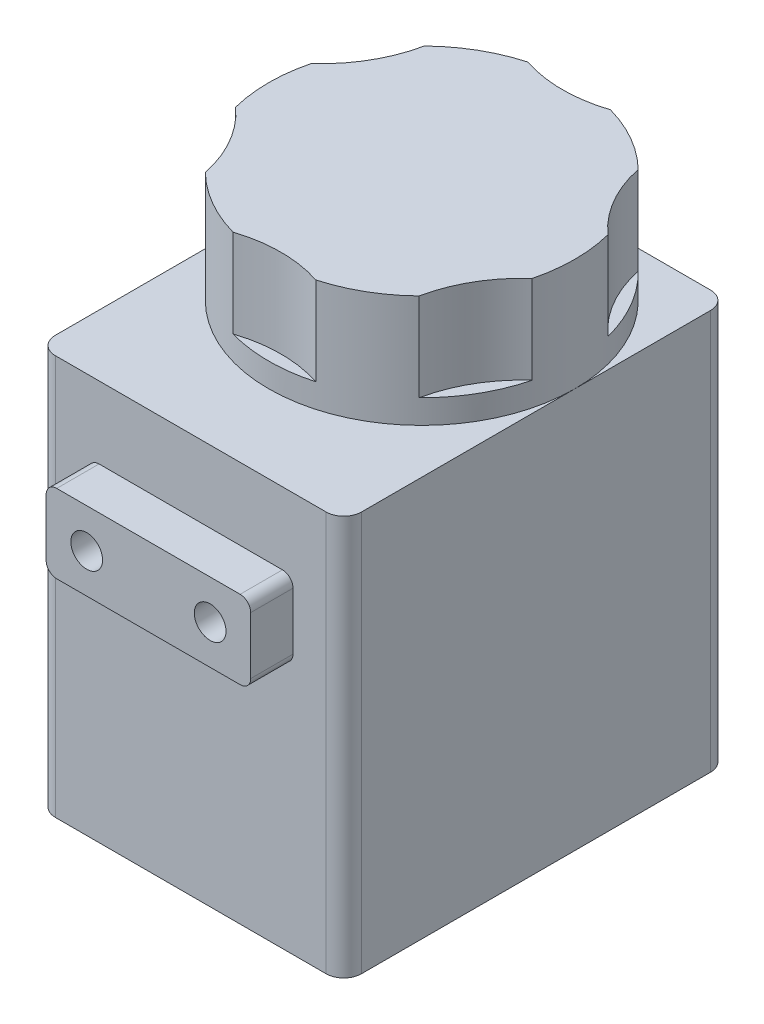
ISO-10303-21;
HEADER;
FILE_DESCRIPTION(('STEP AP214'),'2;1');
FILE_NAME('part.step','',(''),(''),'','','');
FILE_SCHEMA(('AUTOMOTIVE_DESIGN { 1 0 10303 214 1 1 1 1 }'));
ENDSEC;
DATA;
#1=APPLICATION_CONTEXT('core data for automotive mechanical design processes');
#2=APPLICATION_PROTOCOL_DEFINITION('international standard','automotive_design',2000,#1);
#3=PRODUCT_CONTEXT('',#1,'mechanical');
#4=PRODUCT('Part','Part','',(#3));
#5=PRODUCT_RELATED_PRODUCT_CATEGORY('part','',(#4));
#6=PRODUCT_DEFINITION_FORMATION('','',#4);
#7=PRODUCT_DEFINITION_CONTEXT('part definition',#1,'design');
#8=PRODUCT_DEFINITION('design','',#6,#7);
#9=PRODUCT_DEFINITION_SHAPE('','',#8);
#10=(LENGTH_UNIT() NAMED_UNIT(*) SI_UNIT(.MILLI.,.METRE.));
#11=(NAMED_UNIT(*) PLANE_ANGLE_UNIT() SI_UNIT($,.RADIAN.));
#12=(NAMED_UNIT(*) SI_UNIT($,.STERADIAN.) SOLID_ANGLE_UNIT());
#13=UNCERTAINTY_MEASURE_WITH_UNIT(LENGTH_MEASURE(1.E-05),#10,'distance_accuracy_value','');
#14=(GEOMETRIC_REPRESENTATION_CONTEXT(3) GLOBAL_UNCERTAINTY_ASSIGNED_CONTEXT((#13)) GLOBAL_UNIT_ASSIGNED_CONTEXT((#10,
#11,#12)) REPRESENTATION_CONTEXT('',''));
#15=CARTESIAN_POINT('',(0.,0.,0.));
#16=DIRECTION('',(0.,0.,1.));
#17=DIRECTION('',(1.,0.,0.));
#18=AXIS2_PLACEMENT_3D('',#15,#16,#17);
#19=CARTESIAN_POINT('',(0.,28.8036,0.));
#20=DIRECTION('',(0.,-1.,0.));
#21=DIRECTION('',(0.,0.,-1.));
#22=AXIS2_PLACEMENT_3D('',#19,#20,#21);
#23=PLANE('',#22);
#24=DIRECTION('',(0.,0.,-1.));
#25=VECTOR('',#24,1.);
#26=CARTESIAN_POINT('',(22.0472,28.8036,0.));
#27=LINE('',#26,#25);
#28=CARTESIAN_POINT('',(22.0472,28.8036,-16.637));
#29=VERTEX_POINT('',#28);
#30=CARTESIAN_POINT('',(22.0472,28.8036,-26.416));
#31=VERTEX_POINT('',#30);
#32=EDGE_CURVE('E322',#29,#31,#27,.T.);
#33=ORIENTED_EDGE('',*,*,#32,.T.);
#34=CARTESIAN_POINT('',(20.7772,28.8036,-26.416));
#35=DIRECTION('',(0.,-1.,0.));
#36=DIRECTION('',(0.,0.,-1.));
#37=AXIS2_PLACEMENT_3D('',#34,#35,#36);
#38=CIRCLE('',#37,1.27);
#39=CARTESIAN_POINT('',(20.7772,28.8036,-27.686));
#40=VERTEX_POINT('',#39);
#41=EDGE_CURVE('E379',#31,#40,#38,.F.);
#42=ORIENTED_EDGE('',*,*,#41,.T.);
#43=DIRECTION('',(-1.,0.,0.));
#44=VECTOR('',#43,1.);
#45=CARTESIAN_POINT('',(0.,28.8036,-27.686));
#46=LINE('',#45,#44);
#47=CARTESIAN_POINT('',(1.27,28.8036,-27.686));
#48=VERTEX_POINT('',#47);
#49=EDGE_CURVE('E325',#40,#48,#46,.T.);
#50=ORIENTED_EDGE('',*,*,#49,.T.);
#51=CARTESIAN_POINT('',(1.27,28.8036,-26.416));
#52=DIRECTION('',(0.,-1.,0.));
#53=DIRECTION('',(0.,0.,-1.));
#54=AXIS2_PLACEMENT_3D('',#51,#52,#53);
#55=CIRCLE('',#54,1.27);
#56=CARTESIAN_POINT('',(0.,28.8036,-26.416));
#57=VERTEX_POINT('',#56);
#58=EDGE_CURVE('E377',#48,#57,#55,.F.);
#59=ORIENTED_EDGE('',*,*,#58,.T.);
#60=DIRECTION('',(0.,0.,1.));
#61=VECTOR('',#60,1.);
#62=CARTESIAN_POINT('',(0.,28.8036,0.));
#63=LINE('',#62,#61);
#64=CARTESIAN_POINT('',(0.,28.8036,-16.637));
#65=VERTEX_POINT('',#64);
#66=EDGE_CURVE('E316',#57,#65,#63,.T.);
#67=ORIENTED_EDGE('',*,*,#66,.T.);
#68=CARTESIAN_POINT('',(11.0236,28.8036,-16.637));
#69=DIRECTION('',(0.,1.,0.));
#70=DIRECTION('',(0.,0.,1.));
#71=AXIS2_PLACEMENT_3D('',#68,#69,#70);
#72=CIRCLE('',#71,11.0236);
#73=EDGE_CURVE('E284',#29,#65,#72,.T.);
#74=ORIENTED_EDGE('',*,*,#73,.F.);
#75=EDGE_LOOP('',(#33,#42,#50,#59,#67,#74));
#76=FACE_BOUND('',#75,.T.);
#77=ADVANCED_FACE('F32',(#76),#23,.F.);
#78=CARTESIAN_POINT('',(0.,28.8036,0.));
#79=DIRECTION('',(0.,0.,-1.));
#80=DIRECTION('',(-1.,0.,0.));
#81=AXIS2_PLACEMENT_3D('',#78,#79,#80);
#82=PLANE('',#81);
#83=DIRECTION('',(1.,0.,0.));
#84=VECTOR('',#83,1.);
#85=CARTESIAN_POINT('',(0.,0.,0.));
#86=LINE('',#85,#84);
#87=CARTESIAN_POINT('',(1.27,0.,0.));
#88=VERTEX_POINT('',#87);
#89=CARTESIAN_POINT('',(20.7772,0.,0.));
#90=VERTEX_POINT('',#89);
#91=EDGE_CURVE('E330',#88,#90,#86,.T.);
#92=ORIENTED_EDGE('',*,*,#91,.T.);
#93=DIRECTION('',(0.,-1.,0.));
#94=VECTOR('',#93,1.);
#95=CARTESIAN_POINT('',(20.7772,28.8036,0.));
#96=LINE('',#95,#94);
#97=CARTESIAN_POINT('',(20.7772,28.8036,0.));
#98=VERTEX_POINT('',#97);
#99=EDGE_CURVE('E366',#90,#98,#96,.F.);
#100=ORIENTED_EDGE('',*,*,#99,.T.);
#101=DIRECTION('',(1.,0.,0.));
#102=VECTOR('',#101,1.);
#103=CARTESIAN_POINT('',(0.,28.8036,0.));
#104=LINE('',#103,#102);
#105=CARTESIAN_POINT('',(1.27,28.8036,0.));
#106=VERTEX_POINT('',#105);
#107=EDGE_CURVE('E318',#106,#98,#104,.T.);
#108=ORIENTED_EDGE('',*,*,#107,.F.);
#109=DIRECTION('',(0.,-1.,0.));
#110=VECTOR('',#109,1.);
#111=CARTESIAN_POINT('',(1.27,28.8036,0.));
#112=LINE('',#111,#110);
#113=EDGE_CURVE('E363',#106,#88,#112,.T.);
#114=ORIENTED_EDGE('',*,*,#113,.T.);
#115=EDGE_LOOP('',(#92,#100,#108,#114));
#116=FACE_BOUND('',#115,.T.);
#117=DIRECTION('',(0.,1.,0.));
#118=VECTOR('',#117,1.);
#119=CARTESIAN_POINT('',(18.3896,17.9832,0.));
#120=LINE('',#119,#118);
#121=CARTESIAN_POINT('',(18.3896,18.7452,0.));
#122=VERTEX_POINT('',#121);
#123=CARTESIAN_POINT('',(18.3896,22.86,0.));
#124=VERTEX_POINT('',#123);
#125=EDGE_CURVE('E288',#122,#124,#120,.T.);
#126=ORIENTED_EDGE('',*,*,#125,.F.);
#127=CARTESIAN_POINT('',(17.6276,18.7452,0.));
#128=DIRECTION('',(0.,0.,-1.));
#129=DIRECTION('',(-1.,0.,0.));
#130=AXIS2_PLACEMENT_3D('',#127,#128,#129);
#131=CIRCLE('',#130,0.762);
#132=CARTESIAN_POINT('',(17.6276,17.9832,0.));
#133=VERTEX_POINT('',#132);
#134=EDGE_CURVE('E40',#122,#133,#131,.T.);
#135=ORIENTED_EDGE('',*,*,#134,.T.);
#136=DIRECTION('',(1.,0.,0.));
#137=VECTOR('',#136,1.);
#138=CARTESIAN_POINT('',(3.6576,17.9832,0.));
#139=LINE('',#138,#137);
#140=CARTESIAN_POINT('',(4.4196,17.9832,0.));
#141=VERTEX_POINT('',#140);
#142=EDGE_CURVE('E297',#141,#133,#139,.T.);
#143=ORIENTED_EDGE('',*,*,#142,.F.);
#144=CARTESIAN_POINT('',(4.4196,18.7452,0.));
#145=DIRECTION('',(0.,0.,-1.));
#146=DIRECTION('',(-1.,0.,0.));
#147=AXIS2_PLACEMENT_3D('',#144,#145,#146);
#148=CIRCLE('',#147,0.762);
#149=CARTESIAN_POINT('',(3.6576,18.7452,0.));
#150=VERTEX_POINT('',#149);
#151=EDGE_CURVE('E47',#141,#150,#148,.T.);
#152=ORIENTED_EDGE('',*,*,#151,.T.);
#153=DIRECTION('',(0.,-1.,0.));
#154=VECTOR('',#153,1.);
#155=CARTESIAN_POINT('',(3.6576,17.9832,0.));
#156=LINE('',#155,#154);
#157=CARTESIAN_POINT('',(3.6576,22.86,0.));
#158=VERTEX_POINT('',#157);
#159=EDGE_CURVE('E312',#158,#150,#156,.T.);
#160=ORIENTED_EDGE('',*,*,#159,.F.);
#161=CARTESIAN_POINT('',(4.4196,22.86,0.));
#162=DIRECTION('',(0.,0.,-1.));
#163=DIRECTION('',(-1.,0.,0.));
#164=AXIS2_PLACEMENT_3D('',#161,#162,#163);
#165=CIRCLE('',#164,0.762);
#166=CARTESIAN_POINT('',(4.4196,23.622,0.));
#167=VERTEX_POINT('',#166);
#168=EDGE_CURVE('E11',#158,#167,#165,.T.);
#169=ORIENTED_EDGE('',*,*,#168,.T.);
#170=DIRECTION('',(-1.,0.,0.));
#171=VECTOR('',#170,1.);
#172=CARTESIAN_POINT('',(3.6576,23.622,0.));
#173=LINE('',#172,#171);
#174=CARTESIAN_POINT('',(17.6276,23.622,0.));
#175=VERTEX_POINT('',#174);
#176=EDGE_CURVE('E309',#175,#167,#173,.T.);
#177=ORIENTED_EDGE('',*,*,#176,.F.);
#178=CARTESIAN_POINT('',(17.6276,22.86,0.));
#179=DIRECTION('',(0.,0.,-1.));
#180=DIRECTION('',(-1.,0.,0.));
#181=AXIS2_PLACEMENT_3D('',#178,#179,#180);
#182=CIRCLE('',#181,0.762);
#183=EDGE_CURVE('E413',#175,#124,#182,.T.);
#184=ORIENTED_EDGE('',*,*,#183,.T.);
#185=EDGE_LOOP('',(#126,#135,#143,#152,#160,#169,#177,#184));
#186=FACE_BOUND('',#185,.T.);
#187=ADVANCED_FACE('F416',(#116,#186),#82,.F.);
#188=CARTESIAN_POINT('',(0.,28.8036,0.));
#189=DIRECTION('',(1.,0.,0.));
#190=DIRECTION('',(0.,0.,-1.));
#191=AXIS2_PLACEMENT_3D('',#188,#189,#190);
#192=PLANE('',#191);
#193=ORIENTED_EDGE('',*,*,#66,.F.);
#194=DIRECTION('',(0.,-1.,0.));
#195=VECTOR('',#194,1.);
#196=CARTESIAN_POINT('',(0.,28.8036,-26.416));
#197=LINE('',#196,#195);
#198=CARTESIAN_POINT('',(0.,0.,-26.416));
#199=VERTEX_POINT('',#198);
#200=EDGE_CURVE('E383',#57,#199,#197,.T.);
#201=ORIENTED_EDGE('',*,*,#200,.T.);
#202=DIRECTION('',(0.,0.,1.));
#203=VECTOR('',#202,1.);
#204=CARTESIAN_POINT('',(0.,0.,0.));
#205=LINE('',#204,#203);
#206=CARTESIAN_POINT('',(0.,0.,-1.27));
#207=VERTEX_POINT('',#206);
#208=EDGE_CURVE('E306',#199,#207,#205,.T.);
#209=ORIENTED_EDGE('',*,*,#208,.T.);
#210=DIRECTION('',(0.,-1.,0.));
#211=VECTOR('',#210,1.);
#212=CARTESIAN_POINT('',(0.,28.8036,-1.27));
#213=LINE('',#212,#211);
#214=CARTESIAN_POINT('',(0.,28.8036,-1.27));
#215=VERTEX_POINT('',#214);
#216=EDGE_CURVE('E381',#207,#215,#213,.F.);
#217=ORIENTED_EDGE('',*,*,#216,.T.);
#218=EDGE_CURVE('E319',#65,#215,#63,.T.);
#219=ORIENTED_EDGE('',*,*,#218,.F.);
#220=EDGE_LOOP('',(#193,#201,#209,#217,#219));
#221=FACE_BOUND('',#220,.T.);
#222=ADVANCED_FACE('F463',(#221),#192,.F.);
#223=CARTESIAN_POINT('',(22.0472,28.8036,0.));
#224=DIRECTION('',(-1.,0.,0.));
#225=DIRECTION('',(0.,0.,1.));
#226=AXIS2_PLACEMENT_3D('',#223,#224,#225);
#227=PLANE('',#226);
#228=CARTESIAN_POINT('',(22.0472,28.8036,-1.27));
#229=VERTEX_POINT('',#228);
#230=EDGE_CURVE('E323',#229,#29,#27,.T.);
#231=ORIENTED_EDGE('',*,*,#230,.F.);
#232=DIRECTION('',(0.,-1.,0.));
#233=VECTOR('',#232,1.);
#234=CARTESIAN_POINT('',(22.0472,28.8036,-1.27));
#235=LINE('',#234,#233);
#236=CARTESIAN_POINT('',(22.0472,0.,-1.27));
#237=VERTEX_POINT('',#236);
#238=EDGE_CURVE('E352',#229,#237,#235,.T.);
#239=ORIENTED_EDGE('',*,*,#238,.T.);
#240=DIRECTION('',(0.,0.,-1.));
#241=VECTOR('',#240,1.);
#242=CARTESIAN_POINT('',(22.0472,0.,0.));
#243=LINE('',#242,#241);
#244=CARTESIAN_POINT('',(22.0472,0.,-26.416));
#245=VERTEX_POINT('',#244);
#246=EDGE_CURVE('E333',#237,#245,#243,.T.);
#247=ORIENTED_EDGE('',*,*,#246,.T.);
#248=DIRECTION('',(0.,-1.,0.));
#249=VECTOR('',#248,1.);
#250=CARTESIAN_POINT('',(22.0472,28.8036,-26.416));
#251=LINE('',#250,#249);
#252=EDGE_CURVE('E350',#245,#31,#251,.F.);
#253=ORIENTED_EDGE('',*,*,#252,.T.);
#254=ORIENTED_EDGE('',*,*,#32,.F.);
#255=EDGE_LOOP('',(#231,#239,#247,#253,#254));
#256=FACE_BOUND('',#255,.T.);
#257=ADVANCED_FACE('F478',(#256),#227,.F.);
#258=CARTESIAN_POINT('',(0.,28.8036,-27.686));
#259=DIRECTION('',(0.,0.,1.));
#260=DIRECTION('',(1.,0.,0.));
#261=AXIS2_PLACEMENT_3D('',#258,#259,#260);
#262=PLANE('',#261);
#263=ORIENTED_EDGE('',*,*,#49,.F.);
#264=DIRECTION('',(0.,-1.,0.));
#265=VECTOR('',#264,1.);
#266=CARTESIAN_POINT('',(20.7772,28.8036,-27.686));
#267=LINE('',#266,#265);
#268=CARTESIAN_POINT('',(20.7772,0.,-27.686));
#269=VERTEX_POINT('',#268);
#270=EDGE_CURVE('E374',#40,#269,#267,.T.);
#271=ORIENTED_EDGE('',*,*,#270,.T.);
#272=DIRECTION('',(-1.,0.,0.));
#273=VECTOR('',#272,1.);
#274=CARTESIAN_POINT('',(0.,0.,-27.686));
#275=LINE('',#274,#273);
#276=CARTESIAN_POINT('',(1.27,0.,-27.686));
#277=VERTEX_POINT('',#276);
#278=EDGE_CURVE('E336',#269,#277,#275,.T.);
#279=ORIENTED_EDGE('',*,*,#278,.T.);
#280=DIRECTION('',(0.,-1.,0.));
#281=VECTOR('',#280,1.);
#282=CARTESIAN_POINT('',(1.27,28.8036,-27.686));
#283=LINE('',#282,#281);
#284=EDGE_CURVE('E372',#277,#48,#283,.F.);
#285=ORIENTED_EDGE('',*,*,#284,.T.);
#286=EDGE_LOOP('',(#263,#271,#279,#285));
#287=FACE_BOUND('',#286,.T.);
#288=ADVANCED_FACE('F471',(#287),#262,.F.);
#289=ORIENTED_EDGE('',*,*,#107,.T.);
#290=CARTESIAN_POINT('',(20.7772,28.8036,-1.27));
#291=DIRECTION('',(0.,-1.,0.));
#292=DIRECTION('',(0.,0.,-1.));
#293=AXIS2_PLACEMENT_3D('',#290,#291,#292);
#294=CIRCLE('',#293,1.27);
#295=EDGE_CURVE('E370',#98,#229,#294,.F.);
#296=ORIENTED_EDGE('',*,*,#295,.T.);
#297=ORIENTED_EDGE('',*,*,#230,.T.);
#298=EDGE_CURVE('E292',#65,#29,#72,.T.);
#299=ORIENTED_EDGE('',*,*,#298,.F.);
#300=ORIENTED_EDGE('',*,*,#218,.T.);
#301=CARTESIAN_POINT('',(1.27,28.8036,-1.27));
#302=DIRECTION('',(0.,-1.,0.));
#303=DIRECTION('',(0.,0.,-1.));
#304=AXIS2_PLACEMENT_3D('',#301,#302,#303);
#305=CIRCLE('',#304,1.27);
#306=EDGE_CURVE('E368',#215,#106,#305,.F.);
#307=ORIENTED_EDGE('',*,*,#306,.T.);
#308=EDGE_LOOP('',(#289,#296,#297,#299,#300,#307));
#309=FACE_BOUND('',#308,.T.);
#310=ADVANCED_FACE('F459',(#309),#23,.F.);
#311=CARTESIAN_POINT('',(0.,0.,0.));
#312=DIRECTION('',(0.,-1.,0.));
#313=DIRECTION('',(0.,0.,-1.));
#314=AXIS2_PLACEMENT_3D('',#311,#312,#313);
#315=PLANE('',#314);
#316=ORIENTED_EDGE('',*,*,#246,.F.);
#317=CARTESIAN_POINT('',(20.7772,0.,-1.27));
#318=DIRECTION('',(0.,-1.,0.));
#319=DIRECTION('',(0.,0.,-1.));
#320=AXIS2_PLACEMENT_3D('',#317,#318,#319);
#321=CIRCLE('',#320,1.27);
#322=EDGE_CURVE('E361',#237,#90,#321,.T.);
#323=ORIENTED_EDGE('',*,*,#322,.T.);
#324=ORIENTED_EDGE('',*,*,#91,.F.);
#325=CARTESIAN_POINT('',(1.27,0.,-1.27));
#326=DIRECTION('',(0.,-1.,0.));
#327=DIRECTION('',(0.,0.,-1.));
#328=AXIS2_PLACEMENT_3D('',#325,#326,#327);
#329=CIRCLE('',#328,1.27);
#330=EDGE_CURVE('E355',#88,#207,#329,.T.);
#331=ORIENTED_EDGE('',*,*,#330,.T.);
#332=ORIENTED_EDGE('',*,*,#208,.F.);
#333=CARTESIAN_POINT('',(1.27,0.,-26.416));
#334=DIRECTION('',(0.,-1.,0.));
#335=DIRECTION('',(0.,0.,-1.));
#336=AXIS2_PLACEMENT_3D('',#333,#334,#335);
#337=CIRCLE('',#336,1.27);
#338=EDGE_CURVE('E357',#199,#277,#337,.T.);
#339=ORIENTED_EDGE('',*,*,#338,.T.);
#340=ORIENTED_EDGE('',*,*,#278,.F.);
#341=CARTESIAN_POINT('',(20.7772,0.,-26.416));
#342=DIRECTION('',(0.,-1.,0.));
#343=DIRECTION('',(0.,0.,-1.));
#344=AXIS2_PLACEMENT_3D('',#341,#342,#343);
#345=CIRCLE('',#344,1.27);
#346=EDGE_CURVE('E359',#269,#245,#345,.T.);
#347=ORIENTED_EDGE('',*,*,#346,.T.);
#348=EDGE_LOOP('',(#316,#323,#324,#331,#332,#339,#340,#347));
#349=FACE_BOUND('',#348,.T.);
#350=ADVANCED_FACE('F470',(#349),#315,.T.);
#351=CARTESIAN_POINT('',(18.3896,17.9832,3.048));
#352=DIRECTION('',(-1.,0.,0.));
#353=DIRECTION('',(0.,0.,1.));
#354=AXIS2_PLACEMENT_3D('',#351,#352,#353);
#355=PLANE('',#354);
#356=ORIENTED_EDGE('',*,*,#125,.T.);
#357=DIRECTION('',(0.,0.,-1.));
#358=VECTOR('',#357,1.);
#359=CARTESIAN_POINT('',(18.3896,22.86,3.048));
#360=LINE('',#359,#358);
#361=CARTESIAN_POINT('',(18.3896,22.86,3.048));
#362=VERTEX_POINT('',#361);
#363=EDGE_CURVE('E394',#124,#362,#360,.F.);
#364=ORIENTED_EDGE('',*,*,#363,.T.);
#365=DIRECTION('',(0.,1.,0.));
#366=VECTOR('',#365,1.);
#367=CARTESIAN_POINT('',(18.3896,17.9832,3.048));
#368=LINE('',#367,#366);
#369=CARTESIAN_POINT('',(18.3896,18.7452,3.048));
#370=VERTEX_POINT('',#369);
#371=EDGE_CURVE('E293',#370,#362,#368,.T.);
#372=ORIENTED_EDGE('',*,*,#371,.F.);
#373=DIRECTION('',(0.,0.,-1.));
#374=VECTOR('',#373,1.);
#375=CARTESIAN_POINT('',(18.3896,18.7452,3.048));
#376=LINE('',#375,#374);
#377=EDGE_CURVE('E391',#370,#122,#376,.T.);
#378=ORIENTED_EDGE('',*,*,#377,.T.);
#379=EDGE_LOOP('',(#356,#364,#372,#378));
#380=FACE_BOUND('',#379,.T.);
#381=ADVANCED_FACE('F431',(#380),#355,.F.);
#382=CARTESIAN_POINT('',(3.6576,23.622,3.048));
#383=DIRECTION('',(0.,-1.,0.));
#384=DIRECTION('',(0.,0.,-1.));
#385=AXIS2_PLACEMENT_3D('',#382,#383,#384);
#386=PLANE('',#385);
#387=DIRECTION('',(-1.,0.,0.));
#388=VECTOR('',#387,1.);
#389=CARTESIAN_POINT('',(3.6576,23.622,3.048));
#390=LINE('',#389,#388);
#391=CARTESIAN_POINT('',(17.6276,23.622,3.048));
#392=VERTEX_POINT('',#391);
#393=CARTESIAN_POINT('',(4.4196,23.622,3.048));
#394=VERTEX_POINT('',#393);
#395=EDGE_CURVE('E296',#392,#394,#390,.T.);
#396=ORIENTED_EDGE('',*,*,#395,.F.);
#397=DIRECTION('',(0.,0.,-1.));
#398=VECTOR('',#397,1.);
#399=CARTESIAN_POINT('',(17.6276,23.622,3.048));
#400=LINE('',#399,#398);
#401=EDGE_CURVE('E388',#392,#175,#400,.T.);
#402=ORIENTED_EDGE('',*,*,#401,.T.);
#403=ORIENTED_EDGE('',*,*,#176,.T.);
#404=DIRECTION('',(0.,0.,-1.));
#405=VECTOR('',#404,1.);
#406=CARTESIAN_POINT('',(4.4196,23.622,3.048));
#407=LINE('',#406,#405);
#408=EDGE_CURVE('E386',#167,#394,#407,.F.);
#409=ORIENTED_EDGE('',*,*,#408,.T.);
#410=EDGE_LOOP('',(#396,#402,#403,#409));
#411=FACE_BOUND('',#410,.T.);
#412=ADVANCED_FACE('F439',(#411),#386,.F.);
#413=CARTESIAN_POINT('',(3.6576,17.9832,3.048));
#414=DIRECTION('',(1.,0.,0.));
#415=DIRECTION('',(0.,0.,-1.));
#416=AXIS2_PLACEMENT_3D('',#413,#414,#415);
#417=PLANE('',#416);
#418=ORIENTED_EDGE('',*,*,#159,.T.);
#419=DIRECTION('',(0.,0.,-1.));
#420=VECTOR('',#419,1.);
#421=CARTESIAN_POINT('',(3.6576,18.7452,3.048));
#422=LINE('',#421,#420);
#423=CARTESIAN_POINT('',(3.6576,18.7452,3.048));
#424=VERTEX_POINT('',#423);
#425=EDGE_CURVE('E411',#150,#424,#422,.F.);
#426=ORIENTED_EDGE('',*,*,#425,.T.);
#427=DIRECTION('',(0.,-1.,0.));
#428=VECTOR('',#427,1.);
#429=CARTESIAN_POINT('',(3.6576,17.9832,3.048));
#430=LINE('',#429,#428);
#431=CARTESIAN_POINT('',(3.6576,22.86,3.048));
#432=VERTEX_POINT('',#431);
#433=EDGE_CURVE('E300',#432,#424,#430,.T.);
#434=ORIENTED_EDGE('',*,*,#433,.F.);
#435=DIRECTION('',(0.,0.,-1.));
#436=VECTOR('',#435,1.);
#437=CARTESIAN_POINT('',(3.6576,22.86,3.048));
#438=LINE('',#437,#436);
#439=EDGE_CURVE('E409',#432,#158,#438,.T.);
#440=ORIENTED_EDGE('',*,*,#439,.T.);
#441=EDGE_LOOP('',(#418,#426,#434,#440));
#442=FACE_BOUND('',#441,.T.);
#443=ADVANCED_FACE('F444',(#442),#417,.F.);
#444=CARTESIAN_POINT('',(3.6576,17.9832,3.048));
#445=DIRECTION('',(0.,1.,0.));
#446=DIRECTION('',(0.,0.,1.));
#447=AXIS2_PLACEMENT_3D('',#444,#445,#446);
#448=PLANE('',#447);
#449=DIRECTION('',(1.,0.,0.));
#450=VECTOR('',#449,1.);
#451=CARTESIAN_POINT('',(3.6576,17.9832,3.048));
#452=LINE('',#451,#450);
#453=CARTESIAN_POINT('',(4.4196,17.9832,3.048));
#454=VERTEX_POINT('',#453);
#455=CARTESIAN_POINT('',(17.6276,17.9832,3.048));
#456=VERTEX_POINT('',#455);
#457=EDGE_CURVE('E303',#454,#456,#452,.T.);
#458=ORIENTED_EDGE('',*,*,#457,.F.);
#459=DIRECTION('',(0.,0.,-1.));
#460=VECTOR('',#459,1.);
#461=CARTESIAN_POINT('',(4.4196,17.9832,3.048));
#462=LINE('',#461,#460);
#463=EDGE_CURVE('E406',#454,#141,#462,.T.);
#464=ORIENTED_EDGE('',*,*,#463,.T.);
#465=ORIENTED_EDGE('',*,*,#142,.T.);
#466=DIRECTION('',(0.,0.,-1.));
#467=VECTOR('',#466,1.);
#468=CARTESIAN_POINT('',(17.6276,17.9832,3.048));
#469=LINE('',#468,#467);
#470=EDGE_CURVE('E404',#133,#456,#469,.F.);
#471=ORIENTED_EDGE('',*,*,#470,.T.);
#472=EDGE_LOOP('',(#458,#464,#465,#471));
#473=FACE_BOUND('',#472,.T.);
#474=ADVANCED_FACE('F422',(#473),#448,.F.);
#475=CARTESIAN_POINT('',(0.,0.,3.048));
#476=DIRECTION('',(0.,0.,-1.));
#477=DIRECTION('',(-1.,0.,0.));
#478=AXIS2_PLACEMENT_3D('',#475,#476,#477);
#479=PLANE('',#478);
#480=CARTESIAN_POINT('',(15.4686,20.8026,3.048));
#481=DIRECTION('',(0.,0.,1.));
#482=DIRECTION('',(-1.,0.,0.));
#483=AXIS2_PLACEMENT_3D('',#480,#481,#482);
#484=CIRCLE('',#483,1.143);
#485=CARTESIAN_POINT('',(14.3256,20.8026,3.048));
#486=VERTEX_POINT('',#485);
#487=EDGE_CURVE('E705',#486,#486,#484,.T.);
#488=ORIENTED_EDGE('',*,*,#487,.F.);
#489=EDGE_LOOP('',(#488));
#490=FACE_BOUND('',#489,.T.);
#491=CARTESIAN_POINT('',(6.5786,20.8026,3.048));
#492=DIRECTION('',(0.,0.,1.));
#493=DIRECTION('',(1.,0.,0.));
#494=AXIS2_PLACEMENT_3D('',#491,#492,#493);
#495=CIRCLE('',#494,1.143);
#496=CARTESIAN_POINT('',(7.7216,20.8026,3.048));
#497=VERTEX_POINT('',#496);
#498=EDGE_CURVE('E686',#497,#497,#495,.T.);
#499=ORIENTED_EDGE('',*,*,#498,.F.);
#500=EDGE_LOOP('',(#499));
#501=FACE_BOUND('',#500,.T.);
#502=ORIENTED_EDGE('',*,*,#371,.T.);
#503=CARTESIAN_POINT('',(17.6276,22.86,3.048));
#504=DIRECTION('',(0.,0.,-1.));
#505=DIRECTION('',(-1.,0.,0.));
#506=AXIS2_PLACEMENT_3D('',#503,#504,#505);
#507=CIRCLE('',#506,0.762);
#508=EDGE_CURVE('E402',#362,#392,#507,.F.);
#509=ORIENTED_EDGE('',*,*,#508,.T.);
#510=ORIENTED_EDGE('',*,*,#395,.T.);
#511=CARTESIAN_POINT('',(4.4196,22.86,3.048));
#512=DIRECTION('',(0.,0.,-1.));
#513=DIRECTION('',(-1.,0.,0.));
#514=AXIS2_PLACEMENT_3D('',#511,#512,#513);
#515=CIRCLE('',#514,0.762);
#516=EDGE_CURVE('E396',#394,#432,#515,.F.);
#517=ORIENTED_EDGE('',*,*,#516,.T.);
#518=ORIENTED_EDGE('',*,*,#433,.T.);
#519=CARTESIAN_POINT('',(4.4196,18.7452,3.048));
#520=DIRECTION('',(0.,0.,-1.));
#521=DIRECTION('',(-1.,0.,0.));
#522=AXIS2_PLACEMENT_3D('',#519,#520,#521);
#523=CIRCLE('',#522,0.762);
#524=EDGE_CURVE('E400',#424,#454,#523,.F.);
#525=ORIENTED_EDGE('',*,*,#524,.T.);
#526=ORIENTED_EDGE('',*,*,#457,.T.);
#527=CARTESIAN_POINT('',(17.6276,18.7452,3.048));
#528=DIRECTION('',(0.,0.,-1.));
#529=DIRECTION('',(-1.,0.,0.));
#530=AXIS2_PLACEMENT_3D('',#527,#528,#529);
#531=CIRCLE('',#530,0.762);
#532=EDGE_CURVE('E398',#456,#370,#531,.F.);
#533=ORIENTED_EDGE('',*,*,#532,.T.);
#534=EDGE_LOOP('',(#502,#509,#510,#517,#518,#525,#526,#533));
#535=FACE_BOUND('',#534,.T.);
#536=ADVANCED_FACE('F428',(#490,#501,#535),#479,.F.);
#537=CARTESIAN_POINT('',(11.0236,36.8808,-16.637));
#538=DIRECTION('',(0.,-1.,0.));
#539=DIRECTION('',(0.,0.,-1.));
#540=AXIS2_PLACEMENT_3D('',#537,#538,#539);
#541=CYLINDRICAL_SURFACE('',#540,11.0236);
#542=CARTESIAN_POINT('',(11.0236,30.5308,-16.637));
#543=DIRECTION('',(0.,1.,0.));
#544=DIRECTION('',(0.,0.,1.));
#545=AXIS2_PLACEMENT_3D('',#542,#543,#544);
#546=CIRCLE('',#545,11.0236);
#547=CARTESIAN_POINT('',(8.04293778983005,30.5308,-6.02401692506463));
#548=VERTEX_POINT('',#547);
#549=CARTESIAN_POINT('',(14.0042622101698,30.5308,-6.02401692506459));
#550=VERTEX_POINT('',#549);
#551=EDGE_CURVE('E348',#548,#550,#546,.T.);
#552=ORIENTED_EDGE('',*,*,#551,.F.);
#553=DIRECTION('',(0.,1.,0.));
#554=VECTOR('',#553,1.);
#555=CARTESIAN_POINT('',(8.04293778983005,33.7058,-6.02401692506463));
#556=LINE('',#555,#554);
#557=CARTESIAN_POINT('',(8.04293778983005,36.8808,-6.02401692506463));
#558=VERTEX_POINT('',#557);
#559=EDGE_CURVE('E273',#548,#558,#556,.T.);
#560=ORIENTED_EDGE('',*,*,#559,.T.);
#561=CARTESIAN_POINT('',(11.0236,36.8808,-16.637));
#562=DIRECTION('',(0.,1.,0.));
#563=DIRECTION('',(0.,0.,1.));
#564=AXIS2_PLACEMENT_3D('',#561,#562,#563);
#565=CIRCLE('',#564,11.0236);
#566=CARTESIAN_POINT('',(3.32281815225652,36.8808,-8.749179268425));
#567=VERTEX_POINT('',#566);
#568=EDGE_CURVE('E669',#567,#558,#565,.T.);
#569=ORIENTED_EDGE('',*,*,#568,.F.);
#570=DIRECTION('',(0.,1.,0.));
#571=VECTOR('',#570,1.);
#572=CARTESIAN_POINT('',(3.32281815225651,33.7058,-8.749179268425));
#573=LINE('',#572,#571);
#574=CARTESIAN_POINT('',(3.32281815225651,30.5308,-8.749179268425));
#575=VERTEX_POINT('',#574);
#576=EDGE_CURVE('E264',#567,#575,#573,.F.);
#577=ORIENTED_EDGE('',*,*,#576,.T.);
#578=CARTESIAN_POINT('',(11.0236,30.5308,-16.637));
#579=DIRECTION('',(0.,1.,0.));
#580=DIRECTION('',(0.,0.,1.));
#581=AXIS2_PLACEMENT_3D('',#578,#579,#580);
#582=CIRCLE('',#581,11.0236);
#583=CARTESIAN_POINT('',(0.342155942086697,30.5308,-13.9118376566398));
#584=VERTEX_POINT('',#583);
#585=EDGE_CURVE('E346',#584,#575,#582,.T.);
#586=ORIENTED_EDGE('',*,*,#585,.F.);
#587=DIRECTION('',(0.,1.,0.));
#588=VECTOR('',#587,1.);
#589=CARTESIAN_POINT('',(0.342155942086697,33.7058,-13.9118376566398));
#590=LINE('',#589,#588);
#591=CARTESIAN_POINT('',(0.342155942086697,36.8808,-13.9118376566398));
#592=VERTEX_POINT('',#591);
#593=EDGE_CURVE('E267',#584,#592,#590,.T.);
#594=ORIENTED_EDGE('',*,*,#593,.T.);
#595=CARTESIAN_POINT('',(0.342155942086756,36.8808,-19.3621623433605));
#596=VERTEX_POINT('',#595);
#597=EDGE_CURVE('E289',#596,#592,#565,.T.);
#598=ORIENTED_EDGE('',*,*,#597,.F.);
#599=DIRECTION('',(0.,1.,0.));
#600=VECTOR('',#599,1.);
#601=CARTESIAN_POINT('',(0.342155942086756,33.7058,-19.3621623433605));
#602=LINE('',#601,#600);
#603=CARTESIAN_POINT('',(0.34215594208676,30.5308,-19.3621623433605));
#604=VERTEX_POINT('',#603);
#605=EDGE_CURVE('E258',#596,#604,#602,.F.);
#606=ORIENTED_EDGE('',*,*,#605,.T.);
#607=CARTESIAN_POINT('',(11.0236,30.5308,-16.637));
#608=DIRECTION('',(0.,1.,0.));
#609=DIRECTION('',(0.,0.,1.));
#610=AXIS2_PLACEMENT_3D('',#607,#608,#609);
#611=CIRCLE('',#610,11.0236);
#612=CARTESIAN_POINT('',(3.32281815225668,30.5308,-24.5248207315752));
#613=VERTEX_POINT('',#612);
#614=EDGE_CURVE('E344',#613,#604,#611,.T.);
#615=ORIENTED_EDGE('',*,*,#614,.F.);
#616=DIRECTION('',(0.,1.,0.));
#617=VECTOR('',#616,1.);
#618=CARTESIAN_POINT('',(3.32281815225669,33.7058,-24.5248207315752));
#619=LINE('',#618,#617);
#620=CARTESIAN_POINT('',(3.32281815225669,36.8808,-24.5248207315752));
#621=VERTEX_POINT('',#620);
#622=EDGE_CURVE('E261',#613,#621,#619,.T.);
#623=ORIENTED_EDGE('',*,*,#622,.T.);
#624=CARTESIAN_POINT('',(8.04293778983012,36.8808,-27.2499830749354));
#625=VERTEX_POINT('',#624);
#626=EDGE_CURVE('E285',#625,#621,#565,.T.);
#627=ORIENTED_EDGE('',*,*,#626,.F.);
#628=DIRECTION('',(0.,1.,0.));
#629=VECTOR('',#628,1.);
#630=CARTESIAN_POINT('',(8.04293778983012,33.7058,-27.2499830749354));
#631=LINE('',#630,#629);
#632=CARTESIAN_POINT('',(8.04293778983013,30.5308,-27.2499830749354));
#633=VERTEX_POINT('',#632);
#634=EDGE_CURVE('E279',#625,#633,#631,.F.);
#635=ORIENTED_EDGE('',*,*,#634,.T.);
#636=CARTESIAN_POINT('',(11.0236,30.5308,-16.637));
#637=DIRECTION('',(0.,1.,0.));
#638=DIRECTION('',(0.,0.,1.));
#639=AXIS2_PLACEMENT_3D('',#636,#637,#638);
#640=CIRCLE('',#639,11.0236);
#641=CARTESIAN_POINT('',(14.0042622101699,30.5308,-27.2499830749354));
#642=VERTEX_POINT('',#641);
#643=EDGE_CURVE('E231',#642,#633,#640,.T.);
#644=ORIENTED_EDGE('',*,*,#643,.F.);
#645=DIRECTION('',(0.,1.,0.));
#646=VECTOR('',#645,1.);
#647=CARTESIAN_POINT('',(14.0042622101699,33.7058,-27.2499830749354));
#648=LINE('',#647,#646);
#649=CARTESIAN_POINT('',(14.0042622101699,36.8808,-27.2499830749354));
#650=VERTEX_POINT('',#649);
#651=EDGE_CURVE('E282',#642,#650,#648,.T.);
#652=ORIENTED_EDGE('',*,*,#651,.T.);
#653=CARTESIAN_POINT('',(18.7243818477434,36.8808,-24.5248207315751));
#654=VERTEX_POINT('',#653);
#655=EDGE_CURVE('E245',#654,#650,#565,.T.);
#656=ORIENTED_EDGE('',*,*,#655,.F.);
#657=DIRECTION('',(0.,1.,0.));
#658=VECTOR('',#657,1.);
#659=CARTESIAN_POINT('',(18.7243818477434,33.7058,-24.5248207315751));
#660=LINE('',#659,#658);
#661=CARTESIAN_POINT('',(18.7243818477434,30.5308,-24.5248207315751));
#662=VERTEX_POINT('',#661);
#663=EDGE_CURVE('E235',#654,#662,#660,.F.);
#664=ORIENTED_EDGE('',*,*,#663,.T.);
#665=CARTESIAN_POINT('',(11.0236,30.5308,-16.637));
#666=DIRECTION('',(0.,1.,0.));
#667=DIRECTION('',(0.,0.,1.));
#668=AXIS2_PLACEMENT_3D('',#665,#666,#667);
#669=CIRCLE('',#668,11.0236);
#670=CARTESIAN_POINT('',(21.7050440579133,30.5308,-19.3621623433603));
#671=VERTEX_POINT('',#670);
#672=EDGE_CURVE('E223',#671,#662,#669,.T.);
#673=ORIENTED_EDGE('',*,*,#672,.F.);
#674=DIRECTION('',(0.,1.,0.));
#675=VECTOR('',#674,1.);
#676=CARTESIAN_POINT('',(21.7050440579133,33.7058,-19.3621623433603));
#677=LINE('',#676,#675);
#678=CARTESIAN_POINT('',(21.7050440579133,36.8808,-19.3621623433603));
#679=VERTEX_POINT('',#678);
#680=EDGE_CURVE('E237',#671,#679,#677,.T.);
#681=ORIENTED_EDGE('',*,*,#680,.T.);
#682=CARTESIAN_POINT('',(21.7050440579133,36.8808,-13.9118376566397));
#683=VERTEX_POINT('',#682);
#684=EDGE_CURVE('E664',#683,#679,#565,.T.);
#685=ORIENTED_EDGE('',*,*,#684,.F.);
#686=DIRECTION('',(0.,1.,0.));
#687=VECTOR('',#686,1.);
#688=CARTESIAN_POINT('',(21.7050440579133,33.7058,-13.9118376566397));
#689=LINE('',#688,#687);
#690=CARTESIAN_POINT('',(21.7050440579133,30.5308,-13.9118376566397));
#691=VERTEX_POINT('',#690);
#692=EDGE_CURVE('E247',#683,#691,#689,.F.);
#693=ORIENTED_EDGE('',*,*,#692,.T.);
#694=CARTESIAN_POINT('',(11.0236,30.5308,-16.637));
#695=DIRECTION('',(0.,1.,0.));
#696=DIRECTION('',(0.,0.,1.));
#697=AXIS2_PLACEMENT_3D('',#694,#695,#696);
#698=CIRCLE('',#697,11.0236);
#699=CARTESIAN_POINT('',(18.7243818477434,30.5308,-8.74917926842487));
#700=VERTEX_POINT('',#699);
#701=EDGE_CURVE('E230',#700,#691,#698,.T.);
#702=ORIENTED_EDGE('',*,*,#701,.F.);
#703=DIRECTION('',(0.,1.,0.));
#704=VECTOR('',#703,1.);
#705=CARTESIAN_POINT('',(18.7243818477433,33.7058,-8.74917926842487));
#706=LINE('',#705,#704);
#707=CARTESIAN_POINT('',(18.7243818477433,36.8808,-8.74917926842487));
#708=VERTEX_POINT('',#707);
#709=EDGE_CURVE('E255',#700,#708,#706,.T.);
#710=ORIENTED_EDGE('',*,*,#709,.T.);
#711=CARTESIAN_POINT('',(14.0042622101698,36.8808,-6.02401692506459));
#712=VERTEX_POINT('',#711);
#713=EDGE_CURVE('E665',#712,#708,#565,.T.);
#714=ORIENTED_EDGE('',*,*,#713,.F.);
#715=DIRECTION('',(0.,1.,0.));
#716=VECTOR('',#715,1.);
#717=CARTESIAN_POINT('',(14.0042622101698,33.7058,-6.02401692506459));
#718=LINE('',#717,#716);
#719=EDGE_CURVE('E270',#712,#550,#718,.F.);
#720=ORIENTED_EDGE('',*,*,#719,.T.);
#721=EDGE_LOOP('',(#552,#560,#569,#577,#586,#594,#598,#606,#615,#623,#627,#635,#644,#652,#656,
#664,#673,#681,#685,#693,#702,#710,#714,#720));
#722=FACE_BOUND('',#721,.T.);
#723=ORIENTED_EDGE('',*,*,#73,.T.);
#724=ORIENTED_EDGE('',*,*,#298,.T.);
#725=EDGE_LOOP('',(#723,#724));
#726=FACE_BOUND('',#725,.T.);
#727=ADVANCED_FACE('F242',(#722,#726),#541,.T.);
#728=CARTESIAN_POINT('',(11.0236,36.8808,-16.637));
#729=DIRECTION('',(0.,1.,0.));
#730=DIRECTION('',(0.,0.,1.));
#731=AXIS2_PLACEMENT_3D('',#728,#729,#730);
#732=PLANE('',#731);
#733=CARTESIAN_POINT('',(11.0235999999999,36.8808,3.02259999999999));
#734=DIRECTION('',(0.,1.,0.));
#735=DIRECTION('',(0.,0.,1.));
#736=AXIS2_PLACEMENT_3D('',#733,#734,#735);
#737=CIRCLE('',#736,9.525);
#738=EDGE_CURVE('E679',#712,#558,#737,.T.);
#739=ORIENTED_EDGE('',*,*,#738,.F.);
#740=ORIENTED_EDGE('',*,*,#713,.T.);
#741=CARTESIAN_POINT('',(28.0493130282405,36.8808,-6.80719999999993));
#742=DIRECTION('',(0.,1.,0.));
#743=DIRECTION('',(0.,0.,1.));
#744=AXIS2_PLACEMENT_3D('',#741,#742,#743);
#745=CIRCLE('',#744,9.525);
#746=EDGE_CURVE('E250',#683,#708,#745,.T.);
#747=ORIENTED_EDGE('',*,*,#746,.F.);
#748=ORIENTED_EDGE('',*,*,#684,.T.);
#749=CARTESIAN_POINT('',(28.0493130282406,36.8808,-26.4668));
#750=DIRECTION('',(0.,1.,0.));
#751=DIRECTION('',(0.,0.,1.));
#752=AXIS2_PLACEMENT_3D('',#749,#750,#751);
#753=CIRCLE('',#752,9.525);
#754=EDGE_CURVE('E238',#654,#679,#753,.T.);
#755=ORIENTED_EDGE('',*,*,#754,.F.);
#756=ORIENTED_EDGE('',*,*,#655,.T.);
#757=CARTESIAN_POINT('',(11.0236,36.8808,-36.2966));
#758=DIRECTION('',(0.,1.,0.));
#759=DIRECTION('',(0.,0.,1.));
#760=AXIS2_PLACEMENT_3D('',#757,#758,#759);
#761=CIRCLE('',#760,9.525);
#762=EDGE_CURVE('E339',#625,#650,#761,.T.);
#763=ORIENTED_EDGE('',*,*,#762,.F.);
#764=ORIENTED_EDGE('',*,*,#626,.T.);
#765=CARTESIAN_POINT('',(-6.00211302824043,36.8808,-26.4668000000002));
#766=DIRECTION('',(0.,1.,0.));
#767=DIRECTION('',(0.,0.,1.));
#768=AXIS2_PLACEMENT_3D('',#765,#766,#767);
#769=CIRCLE('',#768,9.525);
#770=EDGE_CURVE('E661',#596,#621,#769,.T.);
#771=ORIENTED_EDGE('',*,*,#770,.F.);
#772=ORIENTED_EDGE('',*,*,#597,.T.);
#773=CARTESIAN_POINT('',(-6.00211302824065,36.8808,-6.80720000000016));
#774=DIRECTION('',(0.,1.,0.));
#775=DIRECTION('',(0.,0.,1.));
#776=AXIS2_PLACEMENT_3D('',#773,#774,#775);
#777=CIRCLE('',#776,9.525);
#778=EDGE_CURVE('E674',#567,#592,#777,.T.);
#779=ORIENTED_EDGE('',*,*,#778,.F.);
#780=ORIENTED_EDGE('',*,*,#568,.T.);
#781=EDGE_LOOP('',(#739,#740,#747,#748,#755,#756,#763,#764,#771,#772,#779,#780));
#782=FACE_BOUND('',#781,.T.);
#783=ADVANCED_FACE('F517',(#782),#732,.T.);
#784=CARTESIAN_POINT('',(11.0236,30.5308,-36.2966));
#785=DIRECTION('',(0.,1.,0.));
#786=DIRECTION('',(0.,0.,1.));
#787=AXIS2_PLACEMENT_3D('',#784,#785,#786);
#788=PLANE('',#787);
#789=ORIENTED_EDGE('',*,*,#643,.T.);
#790=CARTESIAN_POINT('',(11.0236,30.5308,-36.2966));
#791=DIRECTION('',(0.,1.,0.));
#792=DIRECTION('',(0.,0.,1.));
#793=AXIS2_PLACEMENT_3D('',#790,#791,#792);
#794=CIRCLE('',#793,9.525);
#795=EDGE_CURVE('E276',#633,#642,#794,.T.);
#796=ORIENTED_EDGE('',*,*,#795,.T.);
#797=EDGE_LOOP('',(#789,#796));
#798=FACE_BOUND('',#797,.T.);
#799=ADVANCED_FACE('F523',(#798),#788,.T.);
#800=CARTESIAN_POINT('',(11.0236,30.5308,-36.2966));
#801=DIRECTION('',(0.,1.,0.));
#802=DIRECTION('',(0.,0.,1.));
#803=AXIS2_PLACEMENT_3D('',#800,#801,#802);
#804=CYLINDRICAL_SURFACE('',#803,9.525);
#805=ORIENTED_EDGE('',*,*,#795,.F.);
#806=ORIENTED_EDGE('',*,*,#634,.F.);
#807=ORIENTED_EDGE('',*,*,#762,.T.);
#808=ORIENTED_EDGE('',*,*,#651,.F.);
#809=EDGE_LOOP('',(#805,#806,#807,#808));
#810=FACE_BOUND('',#809,.T.);
#811=ADVANCED_FACE('F637',(#810),#804,.F.);
#812=CARTESIAN_POINT('',(28.0493130282406,30.5308,-26.4668));
#813=DIRECTION('',(0.,1.,0.));
#814=DIRECTION('',(0.,0.,1.));
#815=AXIS2_PLACEMENT_3D('',#812,#813,#814);
#816=PLANE('',#815);
#817=ORIENTED_EDGE('',*,*,#672,.T.);
#818=CARTESIAN_POINT('',(28.0493130282406,30.5308,-26.4668));
#819=DIRECTION('',(0.,1.,0.));
#820=DIRECTION('',(0.,0.,1.));
#821=AXIS2_PLACEMENT_3D('',#818,#819,#820);
#822=CIRCLE('',#821,9.525);
#823=EDGE_CURVE('E226',#662,#671,#822,.T.);
#824=ORIENTED_EDGE('',*,*,#823,.T.);
#825=EDGE_LOOP('',(#817,#824));
#826=FACE_BOUND('',#825,.T.);
#827=ADVANCED_FACE('F225',(#826),#816,.T.);
#828=CARTESIAN_POINT('',(28.0493130282406,30.5308,-26.4668));
#829=DIRECTION('',(0.,1.,0.));
#830=DIRECTION('',(0.,0.,1.));
#831=AXIS2_PLACEMENT_3D('',#828,#829,#830);
#832=CYLINDRICAL_SURFACE('',#831,9.525);
#833=ORIENTED_EDGE('',*,*,#823,.F.);
#834=ORIENTED_EDGE('',*,*,#663,.F.);
#835=ORIENTED_EDGE('',*,*,#754,.T.);
#836=ORIENTED_EDGE('',*,*,#680,.F.);
#837=EDGE_LOOP('',(#833,#834,#835,#836));
#838=FACE_BOUND('',#837,.T.);
#839=ADVANCED_FACE('F234',(#838),#832,.F.);
#840=CARTESIAN_POINT('',(28.0493130282405,30.5308,-6.80719999999993));
#841=DIRECTION('',(0.,1.,0.));
#842=DIRECTION('',(0.,0.,1.));
#843=AXIS2_PLACEMENT_3D('',#840,#841,#842);
#844=PLANE('',#843);
#845=ORIENTED_EDGE('',*,*,#701,.T.);
#846=CARTESIAN_POINT('',(28.0493130282405,30.5308,-6.80719999999993));
#847=DIRECTION('',(0.,1.,0.));
#848=DIRECTION('',(0.,0.,1.));
#849=AXIS2_PLACEMENT_3D('',#846,#847,#848);
#850=CIRCLE('',#849,9.525);
#851=EDGE_CURVE('E695',#691,#700,#850,.T.);
#852=ORIENTED_EDGE('',*,*,#851,.T.);
#853=EDGE_LOOP('',(#845,#852));
#854=FACE_BOUND('',#853,.T.);
#855=ADVANCED_FACE('F640',(#854),#844,.T.);
#856=CARTESIAN_POINT('',(28.0493130282405,30.5308,-6.80719999999993));
#857=DIRECTION('',(0.,1.,0.));
#858=DIRECTION('',(0.,0.,1.));
#859=AXIS2_PLACEMENT_3D('',#856,#857,#858);
#860=CYLINDRICAL_SURFACE('',#859,9.525);
#861=ORIENTED_EDGE('',*,*,#851,.F.);
#862=ORIENTED_EDGE('',*,*,#692,.F.);
#863=ORIENTED_EDGE('',*,*,#746,.T.);
#864=ORIENTED_EDGE('',*,*,#709,.F.);
#865=EDGE_LOOP('',(#861,#862,#863,#864));
#866=FACE_BOUND('',#865,.T.);
#867=ADVANCED_FACE('F623',(#866),#860,.F.);
#868=CARTESIAN_POINT('',(-6.00211302824043,30.5308,-26.4668000000002));
#869=DIRECTION('',(0.,1.,0.));
#870=DIRECTION('',(0.,0.,1.));
#871=AXIS2_PLACEMENT_3D('',#868,#869,#870);
#872=PLANE('',#871);
#873=ORIENTED_EDGE('',*,*,#614,.T.);
#874=CARTESIAN_POINT('',(-6.00211302824043,30.5308,-26.4668000000002));
#875=DIRECTION('',(0.,1.,0.));
#876=DIRECTION('',(0.,0.,1.));
#877=AXIS2_PLACEMENT_3D('',#874,#875,#876);
#878=CIRCLE('',#877,9.525);
#879=EDGE_CURVE('E683',#604,#613,#878,.T.);
#880=ORIENTED_EDGE('',*,*,#879,.T.);
#881=EDGE_LOOP('',(#873,#880));
#882=FACE_BOUND('',#881,.T.);
#883=ADVANCED_FACE('F620',(#882),#872,.T.);
#884=CARTESIAN_POINT('',(-6.00211302824043,30.5308,-26.4668000000002));
#885=DIRECTION('',(0.,1.,0.));
#886=DIRECTION('',(0.,0.,1.));
#887=AXIS2_PLACEMENT_3D('',#884,#885,#886);
#888=CYLINDRICAL_SURFACE('',#887,9.525);
#889=ORIENTED_EDGE('',*,*,#879,.F.);
#890=ORIENTED_EDGE('',*,*,#605,.F.);
#891=ORIENTED_EDGE('',*,*,#770,.T.);
#892=ORIENTED_EDGE('',*,*,#622,.F.);
#893=EDGE_LOOP('',(#889,#890,#891,#892));
#894=FACE_BOUND('',#893,.T.);
#895=ADVANCED_FACE('F614',(#894),#888,.F.);
#896=CARTESIAN_POINT('',(-6.00211302824065,30.5308,-6.80720000000016));
#897=DIRECTION('',(0.,1.,0.));
#898=DIRECTION('',(0.,0.,1.));
#899=AXIS2_PLACEMENT_3D('',#896,#897,#898);
#900=PLANE('',#899);
#901=ORIENTED_EDGE('',*,*,#585,.T.);
#902=CARTESIAN_POINT('',(-6.00211302824065,30.5308,-6.80720000000016));
#903=DIRECTION('',(0.,1.,0.));
#904=DIRECTION('',(0.,0.,1.));
#905=AXIS2_PLACEMENT_3D('',#902,#903,#904);
#906=CIRCLE('',#905,9.525);
#907=EDGE_CURVE('E678',#575,#584,#906,.T.);
#908=ORIENTED_EDGE('',*,*,#907,.T.);
#909=EDGE_LOOP('',(#901,#908));
#910=FACE_BOUND('',#909,.T.);
#911=ADVANCED_FACE('F610',(#910),#900,.T.);
#912=CARTESIAN_POINT('',(-6.00211302824065,30.5308,-6.80720000000016));
#913=DIRECTION('',(0.,1.,0.));
#914=DIRECTION('',(0.,0.,1.));
#915=AXIS2_PLACEMENT_3D('',#912,#913,#914);
#916=CYLINDRICAL_SURFACE('',#915,9.525);
#917=ORIENTED_EDGE('',*,*,#907,.F.);
#918=ORIENTED_EDGE('',*,*,#576,.F.);
#919=ORIENTED_EDGE('',*,*,#778,.T.);
#920=ORIENTED_EDGE('',*,*,#593,.F.);
#921=EDGE_LOOP('',(#917,#918,#919,#920));
#922=FACE_BOUND('',#921,.T.);
#923=ADVANCED_FACE('F613',(#922),#916,.F.);
#924=CARTESIAN_POINT('',(11.0235999999999,30.5308,3.02259999999999));
#925=DIRECTION('',(0.,1.,0.));
#926=DIRECTION('',(0.,0.,1.));
#927=AXIS2_PLACEMENT_3D('',#924,#925,#926);
#928=PLANE('',#927);
#929=ORIENTED_EDGE('',*,*,#551,.T.);
#930=CARTESIAN_POINT('',(11.0235999999999,30.5308,3.02259999999999));
#931=DIRECTION('',(0.,1.,0.));
#932=DIRECTION('',(0.,0.,1.));
#933=AXIS2_PLACEMENT_3D('',#930,#931,#932);
#934=CIRCLE('',#933,9.525);
#935=EDGE_CURVE('E681',#550,#548,#934,.T.);
#936=ORIENTED_EDGE('',*,*,#935,.T.);
#937=EDGE_LOOP('',(#929,#936));
#938=FACE_BOUND('',#937,.T.);
#939=ADVANCED_FACE('F618',(#938),#928,.T.);
#940=CARTESIAN_POINT('',(11.0235999999999,30.5308,3.02259999999999));
#941=DIRECTION('',(0.,1.,0.));
#942=DIRECTION('',(0.,0.,1.));
#943=AXIS2_PLACEMENT_3D('',#940,#941,#942);
#944=CYLINDRICAL_SURFACE('',#943,9.525);
#945=ORIENTED_EDGE('',*,*,#935,.F.);
#946=ORIENTED_EDGE('',*,*,#719,.F.);
#947=ORIENTED_EDGE('',*,*,#738,.T.);
#948=ORIENTED_EDGE('',*,*,#559,.F.);
#949=EDGE_LOOP('',(#945,#946,#947,#948));
#950=FACE_BOUND('',#949,.T.);
#951=ADVANCED_FACE('F630',(#950),#944,.F.);
#952=CARTESIAN_POINT('',(20.7772,28.8036,-1.27));
#953=DIRECTION('',(0.,-1.,0.));
#954=DIRECTION('',(0.,0.,-1.));
#955=AXIS2_PLACEMENT_3D('',#952,#953,#954);
#956=CYLINDRICAL_SURFACE('',#955,1.27);
#957=ORIENTED_EDGE('',*,*,#295,.F.);
#958=ORIENTED_EDGE('',*,*,#99,.F.);
#959=ORIENTED_EDGE('',*,*,#322,.F.);
#960=ORIENTED_EDGE('',*,*,#238,.F.);
#961=EDGE_LOOP('',(#957,#958,#959,#960));
#962=FACE_BOUND('',#961,.T.);
#963=ADVANCED_FACE('F490',(#962),#956,.T.);
#964=CARTESIAN_POINT('',(20.7772,28.8036,-26.416));
#965=DIRECTION('',(0.,-1.,0.));
#966=DIRECTION('',(0.,0.,-1.));
#967=AXIS2_PLACEMENT_3D('',#964,#965,#966);
#968=CYLINDRICAL_SURFACE('',#967,1.27);
#969=ORIENTED_EDGE('',*,*,#41,.F.);
#970=ORIENTED_EDGE('',*,*,#252,.F.);
#971=ORIENTED_EDGE('',*,*,#346,.F.);
#972=ORIENTED_EDGE('',*,*,#270,.F.);
#973=EDGE_LOOP('',(#969,#970,#971,#972));
#974=FACE_BOUND('',#973,.T.);
#975=ADVANCED_FACE('F500',(#974),#968,.T.);
#976=CARTESIAN_POINT('',(1.27,28.8036,-26.416));
#977=DIRECTION('',(0.,-1.,0.));
#978=DIRECTION('',(0.,0.,-1.));
#979=AXIS2_PLACEMENT_3D('',#976,#977,#978);
#980=CYLINDRICAL_SURFACE('',#979,1.27);
#981=ORIENTED_EDGE('',*,*,#58,.F.);
#982=ORIENTED_EDGE('',*,*,#284,.F.);
#983=ORIENTED_EDGE('',*,*,#338,.F.);
#984=ORIENTED_EDGE('',*,*,#200,.F.);
#985=EDGE_LOOP('',(#981,#982,#983,#984));
#986=FACE_BOUND('',#985,.T.);
#987=ADVANCED_FACE('F507',(#986),#980,.T.);
#988=CARTESIAN_POINT('',(1.27,28.8036,-1.27));
#989=DIRECTION('',(0.,-1.,0.));
#990=DIRECTION('',(0.,0.,-1.));
#991=AXIS2_PLACEMENT_3D('',#988,#989,#990);
#992=CYLINDRICAL_SURFACE('',#991,1.27);
#993=ORIENTED_EDGE('',*,*,#306,.F.);
#994=ORIENTED_EDGE('',*,*,#216,.F.);
#995=ORIENTED_EDGE('',*,*,#330,.F.);
#996=ORIENTED_EDGE('',*,*,#113,.F.);
#997=EDGE_LOOP('',(#993,#994,#995,#996));
#998=FACE_BOUND('',#997,.T.);
#999=ADVANCED_FACE('F454',(#998),#992,.T.);
#1000=CARTESIAN_POINT('',(17.6276,22.86,3.048));
#1001=DIRECTION('',(0.,0.,-1.));
#1002=DIRECTION('',(-1.,0.,0.));
#1003=AXIS2_PLACEMENT_3D('',#1000,#1001,#1002);
#1004=CYLINDRICAL_SURFACE('',#1003,0.762);
#1005=ORIENTED_EDGE('',*,*,#508,.F.);
#1006=ORIENTED_EDGE('',*,*,#363,.F.);
#1007=ORIENTED_EDGE('',*,*,#183,.F.);
#1008=ORIENTED_EDGE('',*,*,#401,.F.);
#1009=EDGE_LOOP('',(#1005,#1006,#1007,#1008));
#1010=FACE_BOUND('',#1009,.T.);
#1011=ADVANCED_FACE('F434',(#1010),#1004,.T.);
#1012=CARTESIAN_POINT('',(4.4196,18.7452,3.048));
#1013=DIRECTION('',(0.,0.,-1.));
#1014=DIRECTION('',(-1.,0.,0.));
#1015=AXIS2_PLACEMENT_3D('',#1012,#1013,#1014);
#1016=CYLINDRICAL_SURFACE('',#1015,0.762);
#1017=ORIENTED_EDGE('',*,*,#524,.F.);
#1018=ORIENTED_EDGE('',*,*,#425,.F.);
#1019=ORIENTED_EDGE('',*,*,#151,.F.);
#1020=ORIENTED_EDGE('',*,*,#463,.F.);
#1021=EDGE_LOOP('',(#1017,#1018,#1019,#1020));
#1022=FACE_BOUND('',#1021,.T.);
#1023=ADVANCED_FACE('F447',(#1022),#1016,.T.);
#1024=CARTESIAN_POINT('',(17.6276,18.7452,3.048));
#1025=DIRECTION('',(0.,0.,-1.));
#1026=DIRECTION('',(-1.,0.,0.));
#1027=AXIS2_PLACEMENT_3D('',#1024,#1025,#1026);
#1028=CYLINDRICAL_SURFACE('',#1027,0.762);
#1029=ORIENTED_EDGE('',*,*,#532,.F.);
#1030=ORIENTED_EDGE('',*,*,#470,.F.);
#1031=ORIENTED_EDGE('',*,*,#134,.F.);
#1032=ORIENTED_EDGE('',*,*,#377,.F.);
#1033=EDGE_LOOP('',(#1029,#1030,#1031,#1032));
#1034=FACE_BOUND('',#1033,.T.);
#1035=ADVANCED_FACE('F425',(#1034),#1028,.T.);
#1036=CARTESIAN_POINT('',(4.4196,22.86,3.048));
#1037=DIRECTION('',(0.,0.,-1.));
#1038=DIRECTION('',(-1.,0.,0.));
#1039=AXIS2_PLACEMENT_3D('',#1036,#1037,#1038);
#1040=CYLINDRICAL_SURFACE('',#1039,0.762);
#1041=ORIENTED_EDGE('',*,*,#516,.F.);
#1042=ORIENTED_EDGE('',*,*,#408,.F.);
#1043=ORIENTED_EDGE('',*,*,#168,.F.);
#1044=ORIENTED_EDGE('',*,*,#439,.F.);
#1045=EDGE_LOOP('',(#1041,#1042,#1043,#1044));
#1046=FACE_BOUND('',#1045,.T.);
#1047=ADVANCED_FACE('F34',(#1046),#1040,.T.);
#1048=CARTESIAN_POINT('',(6.5786,20.8026,0.508));
#1049=DIRECTION('',(0.,0.,1.));
#1050=DIRECTION('',(1.,0.,0.));
#1051=AXIS2_PLACEMENT_3D('',#1048,#1049,#1050);
#1052=CYLINDRICAL_SURFACE('',#1051,1.143);
#1053=CARTESIAN_POINT('',(6.5786,20.8026,0.508));
#1054=DIRECTION('',(0.,0.,1.));
#1055=DIRECTION('',(1.,0.,0.));
#1056=AXIS2_PLACEMENT_3D('',#1053,#1054,#1055);
#1057=CIRCLE('',#1056,1.143);
#1058=CARTESIAN_POINT('',(7.7216,20.8026,0.508));
#1059=VERTEX_POINT('',#1058);
#1060=EDGE_CURVE('E692',#1059,#1059,#1057,.T.);
#1061=ORIENTED_EDGE('',*,*,#1060,.F.);
#1062=EDGE_LOOP('',(#1061));
#1063=FACE_BOUND('',#1062,.T.);
#1064=ORIENTED_EDGE('',*,*,#498,.T.);
#1065=EDGE_LOOP('',(#1064));
#1066=FACE_BOUND('',#1065,.T.);
#1067=ADVANCED_FACE('F569',(#1063,#1066),#1052,.F.);
#1068=CARTESIAN_POINT('',(6.5786,20.8026,0.508));
#1069=DIRECTION('',(0.,0.,1.));
#1070=DIRECTION('',(1.,0.,0.));
#1071=AXIS2_PLACEMENT_3D('',#1068,#1069,#1070);
#1072=PLANE('',#1071);
#1073=ORIENTED_EDGE('',*,*,#1060,.T.);
#1074=EDGE_LOOP('',(#1073));
#1075=FACE_BOUND('',#1074,.T.);
#1076=ADVANCED_FACE('F574',(#1075),#1072,.T.);
#1077=CARTESIAN_POINT('',(15.4686,20.8026,0.508));
#1078=DIRECTION('',(0.,0.,1.));
#1079=DIRECTION('',(1.,0.,0.));
#1080=AXIS2_PLACEMENT_3D('',#1077,#1078,#1079);
#1081=CYLINDRICAL_SURFACE('',#1080,1.143);
#1082=CARTESIAN_POINT('',(15.4686,20.8026,0.508));
#1083=DIRECTION('',(0.,0.,1.));
#1084=DIRECTION('',(-1.,0.,0.));
#1085=AXIS2_PLACEMENT_3D('',#1082,#1083,#1084);
#1086=CIRCLE('',#1085,1.143);
#1087=CARTESIAN_POINT('',(14.3256,20.8026,0.508));
#1088=VERTEX_POINT('',#1087);
#1089=EDGE_CURVE('E703',#1088,#1088,#1086,.T.);
#1090=ORIENTED_EDGE('',*,*,#1089,.F.);
#1091=EDGE_LOOP('',(#1090));
#1092=FACE_BOUND('',#1091,.T.);
#1093=ORIENTED_EDGE('',*,*,#487,.T.);
#1094=EDGE_LOOP('',(#1093));
#1095=FACE_BOUND('',#1094,.T.);
#1096=ADVANCED_FACE('F584',(#1092,#1095),#1081,.F.);
#1097=CARTESIAN_POINT('',(15.4686,20.8026,0.508));
#1098=DIRECTION('',(0.,0.,-1.));
#1099=DIRECTION('',(-1.,0.,0.));
#1100=AXIS2_PLACEMENT_3D('',#1097,#1098,#1099);
#1101=PLANE('',#1100);
#1102=ORIENTED_EDGE('',*,*,#1089,.T.);
#1103=EDGE_LOOP('',(#1102));
#1104=FACE_BOUND('',#1103,.T.);
#1105=ADVANCED_FACE('F594',(#1104),#1101,.F.);
#1106=CLOSED_SHELL('',(#77,#187,#222,#257,#288,#310,#350,#381,#412,#443,#474,#536,#727,#783,
#799,#811,#827,#839,#855,#867,#883,#895,#911,#923,#939,#951,#963,#975,#987,#999,#1011,#1023,
#1035,#1047,#1067,#1076,#1096,#1105));
#1107=MANIFOLD_SOLID_BREP('B2',#1106);
#1108=ADVANCED_BREP_SHAPE_REPRESENTATION('',(#18,#1107),#14);
#1109=SHAPE_DEFINITION_REPRESENTATION(#9,#1108);
ENDSEC;
END-ISO-10303-21;
